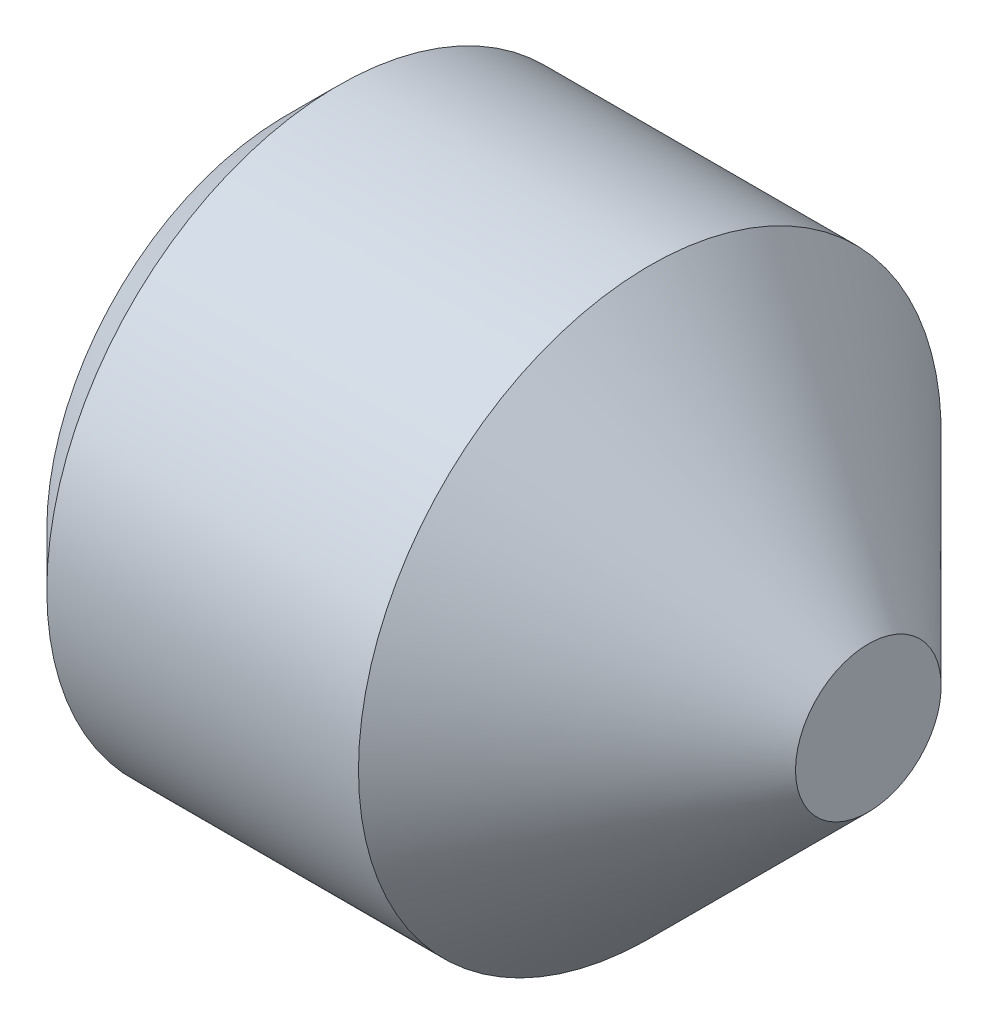
ISO-10303-21;
HEADER;
FILE_DESCRIPTION(('STEP AP214'),'2;1');
FILE_NAME('part.step','',(''),(''),'','','');
FILE_SCHEMA(('AUTOMOTIVE_DESIGN { 1 0 10303 214 1 1 1 1 }'));
ENDSEC;
DATA;
#1=APPLICATION_CONTEXT('core data for automotive mechanical design processes');
#2=APPLICATION_PROTOCOL_DEFINITION('international standard','automotive_design',2000,#1);
#3=PRODUCT_CONTEXT('',#1,'mechanical');
#4=PRODUCT('Part','Part','',(#3));
#5=PRODUCT_RELATED_PRODUCT_CATEGORY('part','',(#4));
#6=PRODUCT_DEFINITION_FORMATION('','',#4);
#7=PRODUCT_DEFINITION_CONTEXT('part definition',#1,'design');
#8=PRODUCT_DEFINITION('design','',#6,#7);
#9=PRODUCT_DEFINITION_SHAPE('','',#8);
#10=(LENGTH_UNIT() NAMED_UNIT(*) SI_UNIT(.MILLI.,.METRE.));
#11=(NAMED_UNIT(*) PLANE_ANGLE_UNIT() SI_UNIT($,.RADIAN.));
#12=(NAMED_UNIT(*) SI_UNIT($,.STERADIAN.) SOLID_ANGLE_UNIT());
#13=UNCERTAINTY_MEASURE_WITH_UNIT(LENGTH_MEASURE(1.E-05),#10,'distance_accuracy_value','');
#14=(GEOMETRIC_REPRESENTATION_CONTEXT(3) GLOBAL_UNCERTAINTY_ASSIGNED_CONTEXT((#13)) GLOBAL_UNIT_ASSIGNED_CONTEXT((#10,
#11,#12)) REPRESENTATION_CONTEXT('',''));
#15=CARTESIAN_POINT('',(0.,0.,0.));
#16=DIRECTION('',(0.,0.,1.));
#17=DIRECTION('',(1.,0.,0.));
#18=AXIS2_PLACEMENT_3D('',#15,#16,#17);
#19=CARTESIAN_POINT('',(1.19999999988631,0.,0.866025403784439));
#20=DIRECTION('',(-1.,0.,0.));
#21=DIRECTION('',(0.,0.,1.));
#22=AXIS2_PLACEMENT_3D('',#19,#20,#21);
#23=PLANE('',#22);
#24=DIRECTION('',(0.,0.,-1.));
#25=VECTOR('',#24,1.);
#26=CARTESIAN_POINT('',(1.19999999988631,0.75,0.433012701892219));
#27=LINE('',#26,#25);
#28=CARTESIAN_POINT('',(1.19999999988631,0.75,0.433012701892219));
#29=VERTEX_POINT('',#28);
#30=CARTESIAN_POINT('',(1.19999999988631,0.75,0.));
#31=VERTEX_POINT('',#30);
#32=EDGE_CURVE('E162',#29,#31,#27,.T.);
#33=ORIENTED_EDGE('',*,*,#32,.T.);
#34=CARTESIAN_POINT('',(1.19999999988631,0.,0.));
#35=DIRECTION('',(1.,0.,0.));
#36=DIRECTION('',(0.,1.,0.));
#37=AXIS2_PLACEMENT_3D('',#34,#35,#36);
#38=CIRCLE('',#37,0.75);
#39=CARTESIAN_POINT('',(1.19999999988631,0.375,0.649519052838329));
#40=VERTEX_POINT('',#39);
#41=EDGE_CURVE('E51',#31,#40,#38,.T.);
#42=ORIENTED_EDGE('',*,*,#41,.T.);
#43=DIRECTION('',(0.,0.866025403784438,-0.5));
#44=VECTOR('',#43,1.);
#45=CARTESIAN_POINT('',(1.19999999988631,0.,0.866025403784439));
#46=LINE('',#45,#44);
#47=EDGE_CURVE('E218',#40,#29,#46,.T.);
#48=ORIENTED_EDGE('',*,*,#47,.T.);
#49=EDGE_LOOP('',(#33,#42,#48));
#50=FACE_BOUND('',#49,.T.);
#51=ADVANCED_FACE('F40',(#50),#23,.T.);
#52=CARTESIAN_POINT('',(1.19999999988631,0.,0.866025403784439));
#53=VERTEX_POINT('',#52);
#54=EDGE_CURVE('E223',#53,#40,#46,.T.);
#55=ORIENTED_EDGE('',*,*,#54,.T.);
#56=CARTESIAN_POINT('',(1.19999999988631,-0.375,0.649519052838329));
#57=VERTEX_POINT('',#56);
#58=EDGE_CURVE('E11',#40,#57,#38,.T.);
#59=ORIENTED_EDGE('',*,*,#58,.T.);
#60=DIRECTION('',(0.,0.866025403784439,0.5));
#61=VECTOR('',#60,1.);
#62=CARTESIAN_POINT('',(1.19999999988631,-0.75,0.43301270189222));
#63=LINE('',#62,#61);
#64=EDGE_CURVE('E188',#57,#53,#63,.T.);
#65=ORIENTED_EDGE('',*,*,#64,.T.);
#66=EDGE_LOOP('',(#55,#59,#65));
#67=FACE_BOUND('',#66,.T.);
#68=ADVANCED_FACE('F127',(#67),#23,.T.);
#69=CARTESIAN_POINT('',(1.19999999988631,-0.75,0.43301270189222));
#70=VERTEX_POINT('',#69);
#71=EDGE_CURVE('E224',#70,#57,#63,.T.);
#72=ORIENTED_EDGE('',*,*,#71,.T.);
#73=CARTESIAN_POINT('',(1.19999999988631,-0.75,0.));
#74=VERTEX_POINT('',#73);
#75=EDGE_CURVE('E49',#57,#74,#38,.T.);
#76=ORIENTED_EDGE('',*,*,#75,.T.);
#77=DIRECTION('',(0.,0.,1.));
#78=VECTOR('',#77,1.);
#79=CARTESIAN_POINT('',(1.19999999988631,-0.75,-0.433012701892219));
#80=LINE('',#79,#78);
#81=EDGE_CURVE('E167',#74,#70,#80,.T.);
#82=ORIENTED_EDGE('',*,*,#81,.T.);
#83=EDGE_LOOP('',(#72,#76,#82));
#84=FACE_BOUND('',#83,.T.);
#85=ADVANCED_FACE('F133',(#84),#23,.T.);
#86=CARTESIAN_POINT('',(1.19999999988631,-0.75,-0.433012701892219));
#87=VERTEX_POINT('',#86);
#88=EDGE_CURVE('E168',#87,#74,#80,.T.);
#89=ORIENTED_EDGE('',*,*,#88,.T.);
#90=CARTESIAN_POINT('',(1.19999999988631,-0.375,-0.649519052838329));
#91=VERTEX_POINT('',#90);
#92=EDGE_CURVE('E215',#74,#91,#38,.T.);
#93=ORIENTED_EDGE('',*,*,#92,.T.);
#94=DIRECTION('',(0.,-0.866025403784439,0.5));
#95=VECTOR('',#94,1.);
#96=CARTESIAN_POINT('',(1.19999999988631,0.,-0.866025403784439));
#97=LINE('',#96,#95);
#98=EDGE_CURVE('E157',#91,#87,#97,.T.);
#99=ORIENTED_EDGE('',*,*,#98,.T.);
#100=EDGE_LOOP('',(#89,#93,#99));
#101=FACE_BOUND('',#100,.T.);
#102=ADVANCED_FACE('F146',(#101),#23,.T.);
#103=CARTESIAN_POINT('',(1.19999999988631,0.,-0.866025403784439));
#104=VERTEX_POINT('',#103);
#105=EDGE_CURVE('E160',#104,#91,#97,.T.);
#106=ORIENTED_EDGE('',*,*,#105,.T.);
#107=CARTESIAN_POINT('',(1.19999999988631,0.375,-0.649519052838329));
#108=VERTEX_POINT('',#107);
#109=EDGE_CURVE('E213',#91,#108,#38,.T.);
#110=ORIENTED_EDGE('',*,*,#109,.T.);
#111=DIRECTION('',(0.,-0.866025403784439,-0.5));
#112=VECTOR('',#111,1.);
#113=CARTESIAN_POINT('',(1.19999999988631,0.75,-0.433012701892219));
#114=LINE('',#113,#112);
#115=EDGE_CURVE('E158',#108,#104,#114,.T.);
#116=ORIENTED_EDGE('',*,*,#115,.T.);
#117=EDGE_LOOP('',(#106,#110,#116));
#118=FACE_BOUND('',#117,.T.);
#119=ADVANCED_FACE('F138',(#118),#23,.T.);
#120=CARTESIAN_POINT('',(1.19999999988631,0.75,-0.433012701892219));
#121=VERTEX_POINT('',#120);
#122=EDGE_CURVE('E150',#121,#108,#114,.T.);
#123=ORIENTED_EDGE('',*,*,#122,.T.);
#124=EDGE_CURVE('E151',#108,#31,#38,.T.);
#125=ORIENTED_EDGE('',*,*,#124,.T.);
#126=EDGE_CURVE('E153',#31,#121,#27,.T.);
#127=ORIENTED_EDGE('',*,*,#126,.T.);
#128=EDGE_LOOP('',(#123,#125,#127));
#129=FACE_BOUND('',#128,.T.);
#130=ADVANCED_FACE('F129',(#129),#23,.T.);
#131=CARTESIAN_POINT('',(0.,1.2295,0.));
#132=DIRECTION('',(1.,0.,0.));
#133=DIRECTION('',(0.,0.,-1.));
#134=AXIS2_PLACEMENT_3D('',#131,#132,#133);
#135=PLANE('',#134);
#136=DIRECTION('',(0.,0.866025403784438,-0.5));
#137=VECTOR('',#136,1.);
#138=CARTESIAN_POINT('',(-1.13686837721616E-10,0.,0.866025403784439));
#139=LINE('',#138,#137);
#140=CARTESIAN_POINT('',(0.,0.,0.866025403784439));
#141=VERTEX_POINT('',#140);
#142=CARTESIAN_POINT('',(-1.13686837721616E-10,0.75,0.433012701892219));
#143=VERTEX_POINT('',#142);
#144=EDGE_CURVE('E173',#141,#143,#139,.T.);
#145=ORIENTED_EDGE('',*,*,#144,.F.);
#146=DIRECTION('',(0.,0.866025403784439,0.5));
#147=VECTOR('',#146,1.);
#148=CARTESIAN_POINT('',(-1.13686837721616E-10,-0.75,0.43301270189222));
#149=LINE('',#148,#147);
#150=CARTESIAN_POINT('',(-1.13686837721616E-10,-0.75,0.43301270189222));
#151=VERTEX_POINT('',#150);
#152=EDGE_CURVE('E65',#151,#141,#149,.T.);
#153=ORIENTED_EDGE('',*,*,#152,.F.);
#154=DIRECTION('',(0.,0.,1.));
#155=VECTOR('',#154,1.);
#156=CARTESIAN_POINT('',(-1.13686837721616E-10,-0.75,-0.433012701892219));
#157=LINE('',#156,#155);
#158=CARTESIAN_POINT('',(-1.13686837721616E-10,-0.75,-0.433012701892219));
#159=VERTEX_POINT('',#158);
#160=EDGE_CURVE('E185',#159,#151,#157,.T.);
#161=ORIENTED_EDGE('',*,*,#160,.F.);
#162=DIRECTION('',(0.,-0.866025403784439,0.5));
#163=VECTOR('',#162,1.);
#164=CARTESIAN_POINT('',(-1.13686837721616E-10,0.,-0.866025403784439));
#165=LINE('',#164,#163);
#166=CARTESIAN_POINT('',(-1.13686837721616E-10,0.,-0.866025403784439));
#167=VERTEX_POINT('',#166);
#168=EDGE_CURVE('E182',#167,#159,#165,.T.);
#169=ORIENTED_EDGE('',*,*,#168,.F.);
#170=DIRECTION('',(0.,-0.866025403784439,-0.5));
#171=VECTOR('',#170,1.);
#172=CARTESIAN_POINT('',(-1.13686837721616E-10,0.75,-0.433012701892219));
#173=LINE('',#172,#171);
#174=CARTESIAN_POINT('',(-1.13686837721616E-10,0.75,-0.433012701892219));
#175=VERTEX_POINT('',#174);
#176=EDGE_CURVE('E179',#175,#167,#173,.T.);
#177=ORIENTED_EDGE('',*,*,#176,.F.);
#178=DIRECTION('',(0.,0.,-1.));
#179=VECTOR('',#178,1.);
#180=CARTESIAN_POINT('',(-1.13686837721616E-10,0.75,0.433012701892219));
#181=LINE('',#180,#179);
#182=EDGE_CURVE('E176',#143,#175,#181,.T.);
#183=ORIENTED_EDGE('',*,*,#182,.F.);
#184=EDGE_LOOP('',(#145,#153,#161,#169,#177,#183));
#185=FACE_BOUND('',#184,.T.);
#186=CARTESIAN_POINT('',(0.,0.,0.));
#187=DIRECTION('',(-1.,0.,0.));
#188=DIRECTION('',(0.,0.,1.));
#189=AXIS2_PLACEMENT_3D('',#186,#187,#188);
#190=CIRCLE('',#189,1.2295);
#191=CARTESIAN_POINT('',(0.,0.,1.2295));
#192=VERTEX_POINT('',#191);
#193=EDGE_CURVE('E191',#192,#192,#190,.T.);
#194=ORIENTED_EDGE('',*,*,#193,.T.);
#195=EDGE_LOOP('',(#194));
#196=FACE_BOUND('',#195,.T.);
#197=ADVANCED_FACE('F42',(#185,#196),#135,.F.);
#198=CARTESIAN_POINT('',(3.,0.,0.));
#199=DIRECTION('',(-1.,0.,0.));
#200=DIRECTION('',(0.,0.,1.));
#201=AXIS2_PLACEMENT_3D('',#198,#199,#200);
#202=PLANE('',#201);
#203=CARTESIAN_POINT('',(3.,0.,0.));
#204=DIRECTION('',(-1.,0.,0.));
#205=DIRECTION('',(0.,0.,1.));
#206=AXIS2_PLACEMENT_3D('',#203,#204,#205);
#207=CIRCLE('',#206,0.375);
#208=CARTESIAN_POINT('',(3.,0.,0.375));
#209=VERTEX_POINT('',#208);
#210=EDGE_CURVE('E44',#209,#209,#207,.T.);
#211=ORIENTED_EDGE('',*,*,#210,.F.);
#212=EDGE_LOOP('',(#211));
#213=FACE_BOUND('',#212,.T.);
#214=ADVANCED_FACE('F144',(#213),#202,.F.);
#215=CARTESIAN_POINT('',(3.,0.,0.));
#216=DIRECTION('',(-1.,0.,0.));
#217=DIRECTION('',(0.,0.,1.));
#218=AXIS2_PLACEMENT_3D('',#215,#216,#217);
#219=CONICAL_SURFACE('',#218,0.375,0.785398163397443);
#220=CARTESIAN_POINT('',(1.87499999999999,0.,0.));
#221=DIRECTION('',(-1.,0.,0.));
#222=DIRECTION('',(0.,0.,1.));
#223=AXIS2_PLACEMENT_3D('',#220,#221,#222);
#224=CIRCLE('',#223,1.5);
#225=CARTESIAN_POINT('',(1.87499999999999,0.,1.5));
#226=VERTEX_POINT('',#225);
#227=EDGE_CURVE('E206',#226,#226,#224,.T.);
#228=ORIENTED_EDGE('',*,*,#227,.F.);
#229=EDGE_LOOP('',(#228));
#230=FACE_BOUND('',#229,.T.);
#231=ORIENTED_EDGE('',*,*,#210,.T.);
#232=EDGE_LOOP('',(#231));
#233=FACE_BOUND('',#232,.T.);
#234=ADVANCED_FACE('F271',(#230,#233),#219,.T.);
#235=CARTESIAN_POINT('',(-14.774129749189,0.,0.));
#236=DIRECTION('',(-1.,0.,0.));
#237=DIRECTION('',(0.,0.,1.));
#238=AXIS2_PLACEMENT_3D('',#235,#236,#237);
#239=CYLINDRICAL_SURFACE('',#238,1.5);
#240=CARTESIAN_POINT('',(0.270500000000002,0.,0.));
#241=DIRECTION('',(-1.,0.,0.));
#242=DIRECTION('',(0.,0.,1.));
#243=AXIS2_PLACEMENT_3D('',#240,#241,#242);
#244=CIRCLE('',#243,1.5);
#245=CARTESIAN_POINT('',(0.270500000000002,0.,1.5));
#246=VERTEX_POINT('',#245);
#247=EDGE_CURVE('E204',#246,#246,#244,.T.);
#248=ORIENTED_EDGE('',*,*,#247,.F.);
#249=EDGE_LOOP('',(#248));
#250=FACE_BOUND('',#249,.T.);
#251=ORIENTED_EDGE('',*,*,#227,.T.);
#252=EDGE_LOOP('',(#251));
#253=FACE_BOUND('',#252,.T.);
#254=ADVANCED_FACE('F267',(#250,#253),#239,.T.);
#255=CARTESIAN_POINT('',(0.270500000000002,0.,0.));
#256=DIRECTION('',(1.,0.,0.));
#257=DIRECTION('',(0.,0.,-1.));
#258=AXIS2_PLACEMENT_3D('',#255,#256,#257);
#259=CONICAL_SURFACE('',#258,1.5,0.785398163397445);
#260=ORIENTED_EDGE('',*,*,#193,.F.);
#261=EDGE_LOOP('',(#260));
#262=FACE_BOUND('',#261,.T.);
#263=ORIENTED_EDGE('',*,*,#247,.T.);
#264=EDGE_LOOP('',(#263));
#265=FACE_BOUND('',#264,.T.);
#266=ADVANCED_FACE('F258',(#262,#265),#259,.T.);
#267=CARTESIAN_POINT('',(1.19999999988631,-0.75,0.43301270189222));
#268=DIRECTION('',(0.,-0.5,0.866025403784439));
#269=DIRECTION('',(0.,-0.866025403784439,-0.5));
#270=AXIS2_PLACEMENT_3D('',#267,#268,#269);
#271=PLANE('',#270);
#272=ORIENTED_EDGE('',*,*,#152,.T.);
#273=DIRECTION('',(-1.,0.,0.));
#274=VECTOR('',#273,1.);
#275=CARTESIAN_POINT('',(1.19999999988631,0.,0.866025403784439));
#276=LINE('',#275,#274);
#277=EDGE_CURVE('E171',#53,#141,#276,.T.);
#278=ORIENTED_EDGE('',*,*,#277,.F.);
#279=ORIENTED_EDGE('',*,*,#64,.F.);
#280=ORIENTED_EDGE('',*,*,#71,.F.);
#281=DIRECTION('',(-1.,0.,0.));
#282=VECTOR('',#281,1.);
#283=CARTESIAN_POINT('',(1.19999999988631,-0.75,0.43301270189222));
#284=LINE('',#283,#282);
#285=EDGE_CURVE('E189',#70,#151,#284,.T.);
#286=ORIENTED_EDGE('',*,*,#285,.T.);
#287=EDGE_LOOP('',(#272,#278,#279,#280,#286));
#288=FACE_BOUND('',#287,.T.);
#289=ADVANCED_FACE('F232',(#288),#271,.F.);
#290=CARTESIAN_POINT('',(1.19999999988631,-0.75,-0.433012701892219));
#291=DIRECTION('',(0.,-1.,0.));
#292=DIRECTION('',(0.,0.,-1.));
#293=AXIS2_PLACEMENT_3D('',#290,#291,#292);
#294=PLANE('',#293);
#295=ORIENTED_EDGE('',*,*,#160,.T.);
#296=ORIENTED_EDGE('',*,*,#285,.F.);
#297=ORIENTED_EDGE('',*,*,#81,.F.);
#298=ORIENTED_EDGE('',*,*,#88,.F.);
#299=DIRECTION('',(-1.,0.,0.));
#300=VECTOR('',#299,1.);
#301=CARTESIAN_POINT('',(1.19999999988631,-0.75,-0.433012701892219));
#302=LINE('',#301,#300);
#303=EDGE_CURVE('E192',#87,#159,#302,.T.);
#304=ORIENTED_EDGE('',*,*,#303,.T.);
#305=EDGE_LOOP('',(#295,#296,#297,#298,#304));
#306=FACE_BOUND('',#305,.T.);
#307=ADVANCED_FACE('F251',(#306),#294,.F.);
#308=CARTESIAN_POINT('',(1.19999999988631,0.,-0.866025403784439));
#309=DIRECTION('',(0.,-0.5,-0.866025403784439));
#310=DIRECTION('',(0.,0.866025403784439,-0.5));
#311=AXIS2_PLACEMENT_3D('',#308,#309,#310);
#312=PLANE('',#311);
#313=ORIENTED_EDGE('',*,*,#168,.T.);
#314=ORIENTED_EDGE('',*,*,#303,.F.);
#315=ORIENTED_EDGE('',*,*,#98,.F.);
#316=ORIENTED_EDGE('',*,*,#105,.F.);
#317=DIRECTION('',(-1.,0.,0.));
#318=VECTOR('',#317,1.);
#319=CARTESIAN_POINT('',(1.19999999988631,0.,-0.866025403784439));
#320=LINE('',#319,#318);
#321=EDGE_CURVE('E194',#104,#167,#320,.T.);
#322=ORIENTED_EDGE('',*,*,#321,.T.);
#323=EDGE_LOOP('',(#313,#314,#315,#316,#322));
#324=FACE_BOUND('',#323,.T.);
#325=ADVANCED_FACE('F245',(#324),#312,.F.);
#326=CARTESIAN_POINT('',(1.19999999988631,0.75,-0.433012701892219));
#327=DIRECTION('',(0.,0.5,-0.866025403784439));
#328=DIRECTION('',(0.,0.866025403784439,0.5));
#329=AXIS2_PLACEMENT_3D('',#326,#327,#328);
#330=PLANE('',#329);
#331=ORIENTED_EDGE('',*,*,#176,.T.);
#332=ORIENTED_EDGE('',*,*,#321,.F.);
#333=ORIENTED_EDGE('',*,*,#115,.F.);
#334=ORIENTED_EDGE('',*,*,#122,.F.);
#335=DIRECTION('',(-1.,0.,0.));
#336=VECTOR('',#335,1.);
#337=CARTESIAN_POINT('',(1.19999999988631,0.75,-0.433012701892219));
#338=LINE('',#337,#336);
#339=EDGE_CURVE('E196',#121,#175,#338,.T.);
#340=ORIENTED_EDGE('',*,*,#339,.T.);
#341=EDGE_LOOP('',(#331,#332,#333,#334,#340));
#342=FACE_BOUND('',#341,.T.);
#343=ADVANCED_FACE('F240',(#342),#330,.F.);
#344=CARTESIAN_POINT('',(1.19999999988631,0.75,0.433012701892219));
#345=DIRECTION('',(0.,1.,0.));
#346=DIRECTION('',(0.,0.,1.));
#347=AXIS2_PLACEMENT_3D('',#344,#345,#346);
#348=PLANE('',#347);
#349=ORIENTED_EDGE('',*,*,#182,.T.);
#350=ORIENTED_EDGE('',*,*,#339,.F.);
#351=ORIENTED_EDGE('',*,*,#126,.F.);
#352=ORIENTED_EDGE('',*,*,#32,.F.);
#353=DIRECTION('',(-1.,0.,0.));
#354=VECTOR('',#353,1.);
#355=CARTESIAN_POINT('',(1.19999999988631,0.75,0.433012701892219));
#356=LINE('',#355,#354);
#357=EDGE_CURVE('E198',#29,#143,#356,.T.);
#358=ORIENTED_EDGE('',*,*,#357,.T.);
#359=EDGE_LOOP('',(#349,#350,#351,#352,#358));
#360=FACE_BOUND('',#359,.T.);
#361=ADVANCED_FACE('F122',(#360),#348,.F.);
#362=CARTESIAN_POINT('',(1.19999999988631,0.,0.866025403784439));
#363=DIRECTION('',(0.,0.5,0.866025403784438));
#364=DIRECTION('',(0.,-0.866025403784439,0.5));
#365=AXIS2_PLACEMENT_3D('',#362,#363,#364);
#366=PLANE('',#365);
#367=ORIENTED_EDGE('',*,*,#144,.T.);
#368=ORIENTED_EDGE('',*,*,#357,.F.);
#369=ORIENTED_EDGE('',*,*,#47,.F.);
#370=ORIENTED_EDGE('',*,*,#54,.F.);
#371=ORIENTED_EDGE('',*,*,#277,.T.);
#372=EDGE_LOOP('',(#367,#368,#369,#370,#371));
#373=FACE_BOUND('',#372,.T.);
#374=ADVANCED_FACE('F117',(#373),#366,.F.);
#375=CARTESIAN_POINT('',(1.63301270177853,0.,0.));
#376=DIRECTION('',(-1.,0.,0.));
#377=DIRECTION('',(0.,-1.,0.));
#378=AXIS2_PLACEMENT_3D('',#375,#376,#377);
#379=CONICAL_SURFACE('',#378,0.,1.0471975511966);
#380=ORIENTED_EDGE('',*,*,#41,.F.);
#381=ORIENTED_EDGE('',*,*,#124,.F.);
#382=ORIENTED_EDGE('',*,*,#109,.F.);
#383=ORIENTED_EDGE('',*,*,#92,.F.);
#384=ORIENTED_EDGE('',*,*,#75,.F.);
#385=ORIENTED_EDGE('',*,*,#58,.F.);
#386=EDGE_LOOP('',(#380,#381,#382,#383,#384,#385));
#387=FACE_BOUND('',#386,.T.);
#388=CARTESIAN_POINT('',(1.63301270177853,0.,0.));
#389=VERTEX_POINT('',#388);
#390=VERTEX_LOOP('',#389);
#391=FACE_BOUND('',#390,.T.);
#392=ADVANCED_FACE('F115',(#387,#391),#379,.F.);
#393=CLOSED_SHELL('',(#51,#68,#85,#102,#119,#130,#197,#214,#234,#254,#266,#289,#307,#325,#343,
#361,#374,#392));
#394=MANIFOLD_SOLID_BREP('B2',#393);
#395=ADVANCED_BREP_SHAPE_REPRESENTATION('',(#18,#394),#14);
#396=SHAPE_DEFINITION_REPRESENTATION(#9,#395);
ENDSEC;
END-ISO-10303-21;
